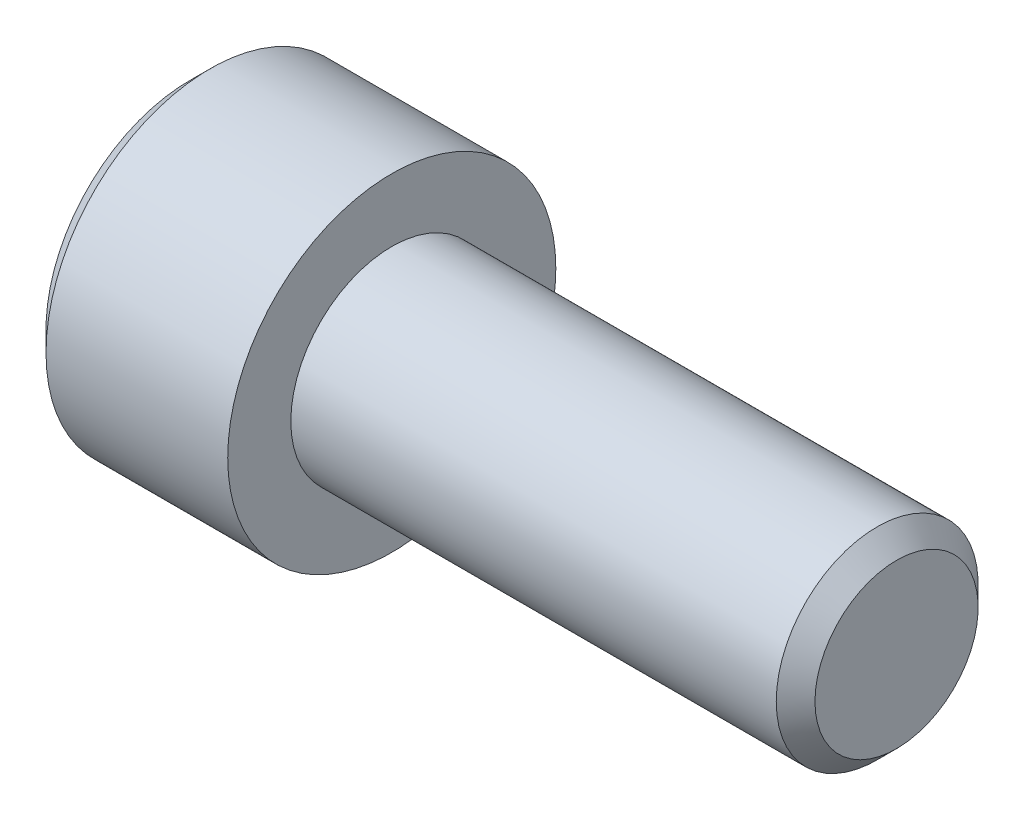
ISO-10303-21;
HEADER;
FILE_DESCRIPTION(('STEP AP214'),'2;1');
FILE_NAME('part.step','',(''),(''),'','','');
FILE_SCHEMA(('AUTOMOTIVE_DESIGN { 1 0 10303 214 1 1 1 1 }'));
ENDSEC;
DATA;
#1=APPLICATION_CONTEXT('core data for automotive mechanical design processes');
#2=APPLICATION_PROTOCOL_DEFINITION('international standard','automotive_design',2000,#1);
#3=PRODUCT_CONTEXT('',#1,'mechanical');
#4=PRODUCT('Part','Part','',(#3));
#5=PRODUCT_RELATED_PRODUCT_CATEGORY('part','',(#4));
#6=PRODUCT_DEFINITION_FORMATION('','',#4);
#7=PRODUCT_DEFINITION_CONTEXT('part definition',#1,'design');
#8=PRODUCT_DEFINITION('design','',#6,#7);
#9=PRODUCT_DEFINITION_SHAPE('','',#8);
#10=(LENGTH_UNIT() NAMED_UNIT(*) SI_UNIT(.MILLI.,.METRE.));
#11=(NAMED_UNIT(*) PLANE_ANGLE_UNIT() SI_UNIT($,.RADIAN.));
#12=(NAMED_UNIT(*) SI_UNIT($,.STERADIAN.) SOLID_ANGLE_UNIT());
#13=UNCERTAINTY_MEASURE_WITH_UNIT(LENGTH_MEASURE(1.E-05),#10,'distance_accuracy_value','');
#14=(GEOMETRIC_REPRESENTATION_CONTEXT(3) GLOBAL_UNCERTAINTY_ASSIGNED_CONTEXT((#13)) GLOBAL_UNIT_ASSIGNED_CONTEXT((#10,
#11,#12)) REPRESENTATION_CONTEXT('',''));
#15=CARTESIAN_POINT('',(0.,0.,0.));
#16=DIRECTION('',(0.,0.,1.));
#17=DIRECTION('',(1.,0.,0.));
#18=AXIS2_PLACEMENT_3D('',#15,#16,#17);
#19=CARTESIAN_POINT('',(-4.,0.,0.));
#20=DIRECTION('',(1.,0.,0.));
#21=DIRECTION('',(0.,0.,-1.));
#22=AXIS2_PLACEMENT_3D('',#19,#20,#21);
#23=PLANE('',#22);
#24=DIRECTION('',(0.,1.,0.));
#25=VECTOR('',#24,1.);
#26=CARTESIAN_POINT('',(-4.,0.,3.));
#27=LINE('',#26,#25);
#28=CARTESIAN_POINT('',(-4.,1.73205080756888,3.));
#29=VERTEX_POINT('',#28);
#30=CARTESIAN_POINT('',(-3.99999999999534,0.,2.99999999999295));
#31=VERTEX_POINT('',#30);
#32=EDGE_CURVE('E109',#29,#31,#27,.F.);
#33=ORIENTED_EDGE('',*,*,#32,.F.);
#34=DIRECTION('',(0.,-0.500000000000001,0.866025403784438));
#35=VECTOR('',#34,1.);
#36=CARTESIAN_POINT('',(-4.,2.59807621135332,1.5));
#37=LINE('',#36,#35);
#38=CARTESIAN_POINT('',(-3.99999999999534,2.59807621134721,1.49999999999647));
#39=VERTEX_POINT('',#38);
#40=EDGE_CURVE('E93',#39,#29,#37,.T.);
#41=ORIENTED_EDGE('',*,*,#40,.F.);
#42=CARTESIAN_POINT('',(-3.99999999999068,0.,0.));
#43=DIRECTION('',(-1.,0.,0.));
#44=DIRECTION('',(0.,0.,1.));
#45=AXIS2_PLACEMENT_3D('',#42,#43,#44);
#46=CIRCLE('',#45,2.9999999999859);
#47=EDGE_CURVE('E20',#39,#31,#46,.F.);
#48=ORIENTED_EDGE('',*,*,#47,.T.);
#49=EDGE_LOOP('',(#33,#41,#48));
#50=FACE_BOUND('',#49,.T.);
#51=ADVANCED_FACE('F17',(#50),#23,.F.);
#52=CARTESIAN_POINT('',(-4.,0.,0.));
#53=DIRECTION('',(1.,0.,0.));
#54=DIRECTION('',(0.,0.,-1.));
#55=AXIS2_PLACEMENT_3D('',#52,#53,#54);
#56=PLANE('',#55);
#57=DIRECTION('',(0.,0.499999999999996,-0.866025403784441));
#58=VECTOR('',#57,1.);
#59=CARTESIAN_POINT('',(-4.,-3.46410161513775,0.));
#60=LINE('',#59,#58);
#61=CARTESIAN_POINT('',(-4.,-3.46410161513775,0.));
#62=VERTEX_POINT('',#61);
#63=CARTESIAN_POINT('',(-3.99999999999534,-2.59807621134721,-1.49999999999648));
#64=VERTEX_POINT('',#63);
#65=EDGE_CURVE('E149',#62,#64,#60,.T.);
#66=ORIENTED_EDGE('',*,*,#65,.F.);
#67=DIRECTION('',(0.,-0.499999999999996,-0.866025403784441));
#68=VECTOR('',#67,1.);
#69=CARTESIAN_POINT('',(-4.,-2.59807621135332,1.5));
#70=LINE('',#69,#68);
#71=CARTESIAN_POINT('',(-3.99999999999534,-2.59807621134721,1.49999999999647));
#72=VERTEX_POINT('',#71);
#73=EDGE_CURVE('E153',#72,#62,#70,.T.);
#74=ORIENTED_EDGE('',*,*,#73,.F.);
#75=CARTESIAN_POINT('',(-3.99999999999068,0.,0.));
#76=DIRECTION('',(-1.,0.,0.));
#77=DIRECTION('',(0.,0.,1.));
#78=AXIS2_PLACEMENT_3D('',#75,#76,#77);
#79=CIRCLE('',#78,2.9999999999859);
#80=EDGE_CURVE('E123',#72,#64,#79,.F.);
#81=ORIENTED_EDGE('',*,*,#80,.T.);
#82=EDGE_LOOP('',(#66,#74,#81));
#83=FACE_BOUND('',#82,.T.);
#84=ADVANCED_FACE('F420',(#83),#56,.F.);
#85=CARTESIAN_POINT('',(-4.,0.,0.));
#86=DIRECTION('',(1.,0.,0.));
#87=DIRECTION('',(0.,0.,-1.));
#88=AXIS2_PLACEMENT_3D('',#85,#86,#87);
#89=PLANE('',#88);
#90=DIRECTION('',(0.,1.,0.));
#91=VECTOR('',#90,1.);
#92=CARTESIAN_POINT('',(-4.,0.,-3.));
#93=LINE('',#92,#91);
#94=CARTESIAN_POINT('',(-4.,-1.73205080756888,-3.));
#95=VERTEX_POINT('',#94);
#96=CARTESIAN_POINT('',(-3.99999999999534,0.,-2.99999999999295));
#97=VERTEX_POINT('',#96);
#98=EDGE_CURVE('E141',#95,#97,#93,.T.);
#99=ORIENTED_EDGE('',*,*,#98,.F.);
#100=DIRECTION('',(0.,0.500000000000001,-0.866025403784438));
#101=VECTOR('',#100,1.);
#102=CARTESIAN_POINT('',(-4.,-2.59807621135332,-1.5));
#103=LINE('',#102,#101);
#104=EDGE_CURVE('E145',#64,#95,#103,.T.);
#105=ORIENTED_EDGE('',*,*,#104,.F.);
#106=CARTESIAN_POINT('',(-3.99999999999068,0.,0.));
#107=DIRECTION('',(-1.,0.,0.));
#108=DIRECTION('',(0.,0.,1.));
#109=AXIS2_PLACEMENT_3D('',#106,#107,#108);
#110=CIRCLE('',#109,2.9999999999859);
#111=EDGE_CURVE('E125',#64,#97,#110,.F.);
#112=ORIENTED_EDGE('',*,*,#111,.T.);
#113=EDGE_LOOP('',(#99,#105,#112));
#114=FACE_BOUND('',#113,.T.);
#115=ADVANCED_FACE('F207',(#114),#89,.F.);
#116=CARTESIAN_POINT('',(-4.,0.,0.));
#117=DIRECTION('',(1.,0.,0.));
#118=DIRECTION('',(0.,0.,-1.));
#119=AXIS2_PLACEMENT_3D('',#116,#117,#118);
#120=PLANE('',#119);
#121=DIRECTION('',(0.,0.500000000000001,0.866025403784438));
#122=VECTOR('',#121,1.);
#123=CARTESIAN_POINT('',(-4.,1.73205080756888,-3.));
#124=LINE('',#123,#122);
#125=CARTESIAN_POINT('',(-4.,1.73205080756888,-3.));
#126=VERTEX_POINT('',#125);
#127=CARTESIAN_POINT('',(-3.99999999999534,2.59807621134721,-1.49999999999647));
#128=VERTEX_POINT('',#127);
#129=EDGE_CURVE('E101',#126,#128,#124,.T.);
#130=ORIENTED_EDGE('',*,*,#129,.F.);
#131=DIRECTION('',(0.,1.,0.));
#132=VECTOR('',#131,1.);
#133=CARTESIAN_POINT('',(-4.,0.,-3.));
#134=LINE('',#133,#132);
#135=EDGE_CURVE('E137',#97,#126,#134,.T.);
#136=ORIENTED_EDGE('',*,*,#135,.F.);
#137=CARTESIAN_POINT('',(-3.99999999999068,0.,0.));
#138=DIRECTION('',(-1.,0.,0.));
#139=DIRECTION('',(0.,0.,1.));
#140=AXIS2_PLACEMENT_3D('',#137,#138,#139);
#141=CIRCLE('',#140,2.9999999999859);
#142=EDGE_CURVE('E117',#97,#128,#141,.F.);
#143=ORIENTED_EDGE('',*,*,#142,.T.);
#144=EDGE_LOOP('',(#130,#136,#143));
#145=FACE_BOUND('',#144,.T.);
#146=ADVANCED_FACE('F210',(#145),#120,.F.);
#147=CARTESIAN_POINT('',(-4.,0.,0.));
#148=DIRECTION('',(1.,0.,0.));
#149=DIRECTION('',(0.,0.,-1.));
#150=AXIS2_PLACEMENT_3D('',#147,#148,#149);
#151=PLANE('',#150);
#152=CARTESIAN_POINT('',(-3.99999999999068,0.,0.));
#153=DIRECTION('',(-1.,0.,0.));
#154=DIRECTION('',(0.,0.,1.));
#155=AXIS2_PLACEMENT_3D('',#152,#153,#154);
#156=CIRCLE('',#155,2.9999999999859);
#157=EDGE_CURVE('E112',#128,#39,#156,.F.);
#158=ORIENTED_EDGE('',*,*,#157,.T.);
#159=DIRECTION('',(0.,-0.499999999999996,0.866025403784441));
#160=VECTOR('',#159,1.);
#161=CARTESIAN_POINT('',(-4.,3.46410161513775,0.));
#162=LINE('',#161,#160);
#163=CARTESIAN_POINT('',(-4.,3.46410161513775,0.));
#164=VERTEX_POINT('',#163);
#165=EDGE_CURVE('E89',#164,#39,#162,.T.);
#166=ORIENTED_EDGE('',*,*,#165,.F.);
#167=DIRECTION('',(0.,0.499999999999996,0.866025403784441));
#168=VECTOR('',#167,1.);
#169=CARTESIAN_POINT('',(-4.,2.59807621135332,-1.5));
#170=LINE('',#169,#168);
#171=EDGE_CURVE('E100',#128,#164,#170,.T.);
#172=ORIENTED_EDGE('',*,*,#171,.F.);
#173=EDGE_LOOP('',(#158,#166,#172));
#174=FACE_BOUND('',#173,.T.);
#175=ADVANCED_FACE('F113',(#174),#151,.F.);
#176=CARTESIAN_POINT('',(-3.99999999999068,0.,0.));
#177=DIRECTION('',(-1.,0.,0.));
#178=DIRECTION('',(0.,0.,1.));
#179=AXIS2_PLACEMENT_3D('',#176,#177,#178);
#180=CONICAL_SURFACE('',#179,2.9999999999859,1.30899693900041);
#181=CARTESIAN_POINT('',(-3.1961524227313,0.,5.6843418860808E-11));
#182=VERTEX_POINT('',#181);
#183=VERTEX_LOOP('',#182);
#184=FACE_BOUND('',#183,.T.);
#185=ORIENTED_EDGE('',*,*,#142,.F.);
#186=ORIENTED_EDGE('',*,*,#111,.F.);
#187=ORIENTED_EDGE('',*,*,#80,.F.);
#188=CARTESIAN_POINT('',(-3.99999999999068,0.,0.));
#189=DIRECTION('',(-1.,0.,0.));
#190=DIRECTION('',(0.,0.,1.));
#191=AXIS2_PLACEMENT_3D('',#188,#189,#190);
#192=CIRCLE('',#191,2.9999999999859);
#193=EDGE_CURVE('E116',#72,#31,#192,.T.);
#194=ORIENTED_EDGE('',*,*,#193,.T.);
#195=ORIENTED_EDGE('',*,*,#47,.F.);
#196=ORIENTED_EDGE('',*,*,#157,.F.);
#197=EDGE_LOOP('',(#185,#186,#187,#194,#195,#196));
#198=FACE_BOUND('',#197,.T.);
#199=ADVANCED_FACE('F119',(#184,#198),#180,.F.);
#200=CARTESIAN_POINT('',(-4.,0.,0.));
#201=DIRECTION('',(1.,0.,0.));
#202=DIRECTION('',(0.,0.,-1.));
#203=AXIS2_PLACEMENT_3D('',#200,#201,#202);
#204=PLANE('',#203);
#205=DIRECTION('',(0.,0.5,0.866025403784439));
#206=VECTOR('',#205,1.);
#207=CARTESIAN_POINT('',(-4.,-1.73205080756888,3.));
#208=LINE('',#207,#206);
#209=CARTESIAN_POINT('',(-4.,-1.73205080756888,3.));
#210=VERTEX_POINT('',#209);
#211=EDGE_CURVE('E197',#210,#72,#208,.F.);
#212=ORIENTED_EDGE('',*,*,#211,.F.);
#213=DIRECTION('',(0.,1.,0.));
#214=VECTOR('',#213,1.);
#215=CARTESIAN_POINT('',(-4.,1.73205080756888,3.));
#216=LINE('',#215,#214);
#217=EDGE_CURVE('E227',#31,#210,#216,.F.);
#218=ORIENTED_EDGE('',*,*,#217,.F.);
#219=ORIENTED_EDGE('',*,*,#193,.F.);
#220=EDGE_LOOP('',(#212,#218,#219));
#221=FACE_BOUND('',#220,.T.);
#222=ADVANCED_FACE('F240',(#221),#204,.F.);
#223=CARTESIAN_POINT('',(-4.,-1.73205080756888,3.));
#224=DIRECTION('',(0.,0.866025403784439,-0.5));
#225=DIRECTION('',(0.,0.5,0.866025403784439));
#226=AXIS2_PLACEMENT_3D('',#223,#224,#225);
#227=PLANE('',#226);
#228=ORIENTED_EDGE('',*,*,#73,.T.);
#229=DIRECTION('',(1.,0.,0.));
#230=VECTOR('',#229,1.);
#231=CARTESIAN_POINT('',(-4.,-3.46410161513775,0.));
#232=LINE('',#231,#230);
#233=CARTESIAN_POINT('',(-8.,-3.46410161513775,0.));
#234=VERTEX_POINT('',#233);
#235=EDGE_CURVE('E170',#234,#62,#232,.T.);
#236=ORIENTED_EDGE('',*,*,#235,.F.);
#237=DIRECTION('',(0.,0.499999999999998,0.86602540378444));
#238=VECTOR('',#237,1.);
#239=CARTESIAN_POINT('',(-8.,-3.46410161513775,0.));
#240=LINE('',#239,#238);
#241=CARTESIAN_POINT('',(-8.,-1.73205080756888,3.));
#242=VERTEX_POINT('',#241);
#243=EDGE_CURVE('E175',#234,#242,#240,.T.);
#244=ORIENTED_EDGE('',*,*,#243,.T.);
#245=DIRECTION('',(-1.,0.,0.));
#246=VECTOR('',#245,1.);
#247=CARTESIAN_POINT('',(-4.,-1.73205080756888,3.));
#248=LINE('',#247,#246);
#249=EDGE_CURVE('E183',#210,#242,#248,.T.);
#250=ORIENTED_EDGE('',*,*,#249,.F.);
#251=ORIENTED_EDGE('',*,*,#211,.T.);
#252=EDGE_LOOP('',(#228,#236,#244,#250,#251));
#253=FACE_BOUND('',#252,.T.);
#254=ADVANCED_FACE('F238',(#253),#227,.T.);
#255=CARTESIAN_POINT('',(-4.,1.73205080756888,3.));
#256=DIRECTION('',(0.,0.,-1.));
#257=DIRECTION('',(-1.,0.,0.));
#258=AXIS2_PLACEMENT_3D('',#255,#256,#257);
#259=PLANE('',#258);
#260=ORIENTED_EDGE('',*,*,#217,.T.);
#261=ORIENTED_EDGE('',*,*,#249,.T.);
#262=DIRECTION('',(0.,1.,0.));
#263=VECTOR('',#262,1.);
#264=CARTESIAN_POINT('',(-8.,0.,3.));
#265=LINE('',#264,#263);
#266=CARTESIAN_POINT('',(-8.,1.73205080756888,3.));
#267=VERTEX_POINT('',#266);
#268=EDGE_CURVE('E221',#242,#267,#265,.T.);
#269=ORIENTED_EDGE('',*,*,#268,.T.);
#270=DIRECTION('',(1.,0.,0.));
#271=VECTOR('',#270,1.);
#272=CARTESIAN_POINT('',(-4.,1.73205080756887,3.));
#273=LINE('',#272,#271);
#274=EDGE_CURVE('E166',#29,#267,#273,.F.);
#275=ORIENTED_EDGE('',*,*,#274,.F.);
#276=ORIENTED_EDGE('',*,*,#32,.T.);
#277=EDGE_LOOP('',(#260,#261,#269,#275,#276));
#278=FACE_BOUND('',#277,.T.);
#279=ADVANCED_FACE('F242',(#278),#259,.T.);
#280=CARTESIAN_POINT('',(-4.,3.46410161513775,0.));
#281=DIRECTION('',(0.,-0.866025403784439,-0.5));
#282=DIRECTION('',(0.,0.5,-0.866025403784439));
#283=AXIS2_PLACEMENT_3D('',#280,#281,#282);
#284=PLANE('',#283);
#285=ORIENTED_EDGE('',*,*,#40,.T.);
#286=ORIENTED_EDGE('',*,*,#274,.T.);
#287=DIRECTION('',(0.,0.499999999999998,-0.86602540378444));
#288=VECTOR('',#287,1.);
#289=CARTESIAN_POINT('',(-8.,1.73205080756888,3.));
#290=LINE('',#289,#288);
#291=CARTESIAN_POINT('',(-8.,3.46410161513775,0.));
#292=VERTEX_POINT('',#291);
#293=EDGE_CURVE('E218',#267,#292,#290,.T.);
#294=ORIENTED_EDGE('',*,*,#293,.T.);
#295=DIRECTION('',(1.,0.,0.));
#296=VECTOR('',#295,1.);
#297=CARTESIAN_POINT('',(-4.,3.46410161513776,0.));
#298=LINE('',#297,#296);
#299=EDGE_CURVE('E96',#164,#292,#298,.F.);
#300=ORIENTED_EDGE('',*,*,#299,.F.);
#301=ORIENTED_EDGE('',*,*,#165,.T.);
#302=EDGE_LOOP('',(#285,#286,#294,#300,#301));
#303=FACE_BOUND('',#302,.T.);
#304=ADVANCED_FACE('F91',(#303),#284,.T.);
#305=CARTESIAN_POINT('',(-4.,1.73205080756888,-3.));
#306=DIRECTION('',(0.,-0.866025403784439,0.5));
#307=DIRECTION('',(0.,-0.5,-0.866025403784439));
#308=AXIS2_PLACEMENT_3D('',#305,#306,#307);
#309=PLANE('',#308);
#310=ORIENTED_EDGE('',*,*,#171,.T.);
#311=ORIENTED_EDGE('',*,*,#299,.T.);
#312=DIRECTION('',(0.,-0.499999999999998,-0.86602540378444));
#313=VECTOR('',#312,1.);
#314=CARTESIAN_POINT('',(-8.,3.46410161513775,0.));
#315=LINE('',#314,#313);
#316=CARTESIAN_POINT('',(-8.,1.73205080756888,-3.));
#317=VERTEX_POINT('',#316);
#318=EDGE_CURVE('E215',#292,#317,#315,.T.);
#319=ORIENTED_EDGE('',*,*,#318,.T.);
#320=DIRECTION('',(1.,0.,0.));
#321=VECTOR('',#320,1.);
#322=CARTESIAN_POINT('',(-4.,1.73205080756888,-3.));
#323=LINE('',#322,#321);
#324=EDGE_CURVE('E165',#126,#317,#323,.F.);
#325=ORIENTED_EDGE('',*,*,#324,.F.);
#326=ORIENTED_EDGE('',*,*,#129,.T.);
#327=EDGE_LOOP('',(#310,#311,#319,#325,#326));
#328=FACE_BOUND('',#327,.T.);
#329=ADVANCED_FACE('F213',(#328),#309,.T.);
#330=CARTESIAN_POINT('',(-4.,-1.73205080756888,-3.));
#331=DIRECTION('',(0.,0.,1.));
#332=DIRECTION('',(1.,0.,0.));
#333=AXIS2_PLACEMENT_3D('',#330,#331,#332);
#334=PLANE('',#333);
#335=ORIENTED_EDGE('',*,*,#135,.T.);
#336=ORIENTED_EDGE('',*,*,#324,.T.);
#337=DIRECTION('',(0.,1.,0.));
#338=VECTOR('',#337,1.);
#339=CARTESIAN_POINT('',(-8.,0.,-3.));
#340=LINE('',#339,#338);
#341=CARTESIAN_POINT('',(-8.,-1.73205080756888,-3.));
#342=VERTEX_POINT('',#341);
#343=EDGE_CURVE('E35',#317,#342,#340,.F.);
#344=ORIENTED_EDGE('',*,*,#343,.T.);
#345=DIRECTION('',(1.,0.,0.));
#346=VECTOR('',#345,1.);
#347=CARTESIAN_POINT('',(-4.,-1.73205080756887,-3.));
#348=LINE('',#347,#346);
#349=EDGE_CURVE('E173',#95,#342,#348,.F.);
#350=ORIENTED_EDGE('',*,*,#349,.F.);
#351=ORIENTED_EDGE('',*,*,#98,.T.);
#352=EDGE_LOOP('',(#335,#336,#344,#350,#351));
#353=FACE_BOUND('',#352,.T.);
#354=ADVANCED_FACE('F212',(#353),#334,.T.);
#355=CARTESIAN_POINT('',(-4.,-3.46410161513775,0.));
#356=DIRECTION('',(0.,0.866025403784439,0.5));
#357=DIRECTION('',(0.,-0.5,0.866025403784439));
#358=AXIS2_PLACEMENT_3D('',#355,#356,#357);
#359=PLANE('',#358);
#360=ORIENTED_EDGE('',*,*,#104,.T.);
#361=ORIENTED_EDGE('',*,*,#349,.T.);
#362=DIRECTION('',(0.,-0.499999999999998,0.86602540378444));
#363=VECTOR('',#362,1.);
#364=CARTESIAN_POINT('',(-8.,-1.73205080756888,-3.));
#365=LINE('',#364,#363);
#366=EDGE_CURVE('E196',#342,#234,#365,.T.);
#367=ORIENTED_EDGE('',*,*,#366,.T.);
#368=ORIENTED_EDGE('',*,*,#235,.T.);
#369=ORIENTED_EDGE('',*,*,#65,.T.);
#370=EDGE_LOOP('',(#360,#361,#367,#368,#369));
#371=FACE_BOUND('',#370,.T.);
#372=ADVANCED_FACE('F251',(#371),#359,.T.);
#373=CARTESIAN_POINT('',(-8.,0.,0.));
#374=DIRECTION('',(1.,0.,0.));
#375=DIRECTION('',(0.,0.,-1.));
#376=AXIS2_PLACEMENT_3D('',#373,#374,#375);
#377=PLANE('',#376);
#378=ORIENTED_EDGE('',*,*,#343,.F.);
#379=ORIENTED_EDGE('',*,*,#318,.F.);
#380=ORIENTED_EDGE('',*,*,#293,.F.);
#381=ORIENTED_EDGE('',*,*,#268,.F.);
#382=ORIENTED_EDGE('',*,*,#243,.F.);
#383=ORIENTED_EDGE('',*,*,#366,.F.);
#384=EDGE_LOOP('',(#378,#379,#380,#381,#382,#383));
#385=FACE_BOUND('',#384,.T.);
#386=CARTESIAN_POINT('',(-8.0000000000382,0.,0.));
#387=DIRECTION('',(1.,0.,0.));
#388=DIRECTION('',(0.,0.,-1.));
#389=AXIS2_PLACEMENT_3D('',#386,#387,#388);
#390=CIRCLE('',#389,5.69999999993342);
#391=CARTESIAN_POINT('',(-8.0000000000382,0.,-5.69999999993342));
#392=VERTEX_POINT('',#391);
#393=EDGE_CURVE('E193',#392,#392,#390,.T.);
#394=ORIENTED_EDGE('',*,*,#393,.F.);
#395=EDGE_LOOP('',(#394));
#396=FACE_BOUND('',#395,.T.);
#397=ADVANCED_FACE('F244',(#385,#396),#377,.F.);
#398=CARTESIAN_POINT('',(-7.20000000006848,0.,0.));
#399=DIRECTION('',(1.,0.,0.));
#400=DIRECTION('',(0.,0.,-1.));
#401=AXIS2_PLACEMENT_3D('',#398,#399,#400);
#402=CONICAL_SURFACE('',#401,6.49999999990314,0.785398163397448);
#403=ORIENTED_EDGE('',*,*,#393,.T.);
#404=EDGE_LOOP('',(#403));
#405=FACE_BOUND('',#404,.T.);
#406=CARTESIAN_POINT('',(-7.2,0.,0.));
#407=DIRECTION('',(-1.,0.,0.));
#408=DIRECTION('',(0.,0.,1.));
#409=AXIS2_PLACEMENT_3D('',#406,#407,#408);
#410=CIRCLE('',#409,6.5);
#411=CARTESIAN_POINT('',(-7.2,0.,6.5));
#412=VERTEX_POINT('',#411);
#413=EDGE_CURVE('E192',#412,#412,#410,.F.);
#414=ORIENTED_EDGE('',*,*,#413,.F.);
#415=EDGE_LOOP('',(#414));
#416=FACE_BOUND('',#415,.T.);
#417=ADVANCED_FACE('F274',(#405,#416),#402,.T.);
#418=CARTESIAN_POINT('',(20.,3.233,0.));
#419=DIRECTION('',(-1.,0.,0.));
#420=DIRECTION('',(0.,0.,1.));
#421=AXIS2_PLACEMENT_3D('',#418,#419,#420);
#422=PLANE('',#421);
#423=CARTESIAN_POINT('',(19.9999999999818,0.,0.));
#424=DIRECTION('',(-1.,0.,0.));
#425=DIRECTION('',(0.,0.,1.));
#426=AXIS2_PLACEMENT_3D('',#423,#424,#425);
#427=CIRCLE('',#426,3.23299999996607);
#428=CARTESIAN_POINT('',(19.9999999999818,0.,3.23299999996607));
#429=VERTEX_POINT('',#428);
#430=EDGE_CURVE('E189',#429,#429,#427,.T.);
#431=ORIENTED_EDGE('',*,*,#430,.F.);
#432=EDGE_LOOP('',(#431));
#433=FACE_BOUND('',#432,.T.);
#434=ADVANCED_FACE('F272',(#433),#422,.F.);
#435=CARTESIAN_POINT('',(20.,0.,0.));
#436=DIRECTION('',(-1.,0.,0.));
#437=DIRECTION('',(0.,0.,1.));
#438=AXIS2_PLACEMENT_3D('',#435,#436,#437);
#439=CYLINDRICAL_SURFACE('',#438,6.5);
#440=ORIENTED_EDGE('',*,*,#413,.T.);
#441=EDGE_LOOP('',(#440));
#442=FACE_BOUND('',#441,.T.);
#443=CARTESIAN_POINT('',(0.,0.,0.));
#444=DIRECTION('',(-1.,0.,0.));
#445=DIRECTION('',(0.,0.,1.));
#446=AXIS2_PLACEMENT_3D('',#443,#444,#445);
#447=CIRCLE('',#446,6.5);
#448=CARTESIAN_POINT('',(0.,0.,6.5));
#449=VERTEX_POINT('',#448);
#450=EDGE_CURVE('E186',#449,#449,#447,.T.);
#451=ORIENTED_EDGE('',*,*,#450,.T.);
#452=EDGE_LOOP('',(#451));
#453=FACE_BOUND('',#452,.T.);
#454=ADVANCED_FACE('F268',(#442,#453),#439,.T.);
#455=CARTESIAN_POINT('',(19.2329999999856,0.,0.));
#456=DIRECTION('',(-1.,0.,0.));
#457=DIRECTION('',(0.,0.,1.));
#458=AXIS2_PLACEMENT_3D('',#455,#456,#457);
#459=CONICAL_SURFACE('',#458,4.0000000000191,0.785398163434504);
#460=CARTESIAN_POINT('',(19.233,0.,0.));
#461=DIRECTION('',(-1.,0.,0.));
#462=DIRECTION('',(0.,0.,1.));
#463=AXIS2_PLACEMENT_3D('',#460,#461,#462);
#464=CIRCLE('',#463,4.);
#465=CARTESIAN_POINT('',(19.233,0.,4.));
#466=VERTEX_POINT('',#465);
#467=EDGE_CURVE('E26',#466,#466,#464,.T.);
#468=ORIENTED_EDGE('',*,*,#467,.F.);
#469=EDGE_LOOP('',(#468));
#470=FACE_BOUND('',#469,.T.);
#471=ORIENTED_EDGE('',*,*,#430,.T.);
#472=EDGE_LOOP('',(#471));
#473=FACE_BOUND('',#472,.T.);
#474=ADVANCED_FACE('F264',(#470,#473),#459,.T.);
#475=CARTESIAN_POINT('',(0.,6.5,0.));
#476=DIRECTION('',(-1.,0.,0.));
#477=DIRECTION('',(0.,0.,1.));
#478=AXIS2_PLACEMENT_3D('',#475,#476,#477);
#479=PLANE('',#478);
#480=ORIENTED_EDGE('',*,*,#450,.F.);
#481=EDGE_LOOP('',(#480));
#482=FACE_BOUND('',#481,.T.);
#483=CARTESIAN_POINT('',(0.,0.,0.));
#484=DIRECTION('',(-1.,0.,0.));
#485=DIRECTION('',(0.,0.,1.));
#486=AXIS2_PLACEMENT_3D('',#483,#484,#485);
#487=CIRCLE('',#486,4.);
#488=CARTESIAN_POINT('',(0.,0.,4.));
#489=VERTEX_POINT('',#488);
#490=EDGE_CURVE('E11',#489,#489,#487,.F.);
#491=ORIENTED_EDGE('',*,*,#490,.F.);
#492=EDGE_LOOP('',(#491));
#493=FACE_BOUND('',#492,.T.);
#494=ADVANCED_FACE('F267',(#482,#493),#479,.F.);
#495=CARTESIAN_POINT('',(20.,0.,0.));
#496=DIRECTION('',(-1.,0.,0.));
#497=DIRECTION('',(0.,0.,1.));
#498=AXIS2_PLACEMENT_3D('',#495,#496,#497);
#499=CYLINDRICAL_SURFACE('',#498,4.);
#500=ORIENTED_EDGE('',*,*,#490,.T.);
#501=EDGE_LOOP('',(#500));
#502=FACE_BOUND('',#501,.T.);
#503=ORIENTED_EDGE('',*,*,#467,.T.);
#504=EDGE_LOOP('',(#503));
#505=FACE_BOUND('',#504,.T.);
#506=ADVANCED_FACE('F262',(#502,#505),#499,.T.);
#507=CLOSED_SHELL('',(#51,#84,#115,#146,#175,#199,#222,#254,#279,#304,#329,#354,#372,#397,#417,
#434,#454,#474,#494,#506));
#508=MANIFOLD_SOLID_BREP('B1',#507);
#509=ADVANCED_BREP_SHAPE_REPRESENTATION('',(#18,#508),#14);
#510=SHAPE_DEFINITION_REPRESENTATION(#9,#509);
ENDSEC;
END-ISO-10303-21;
